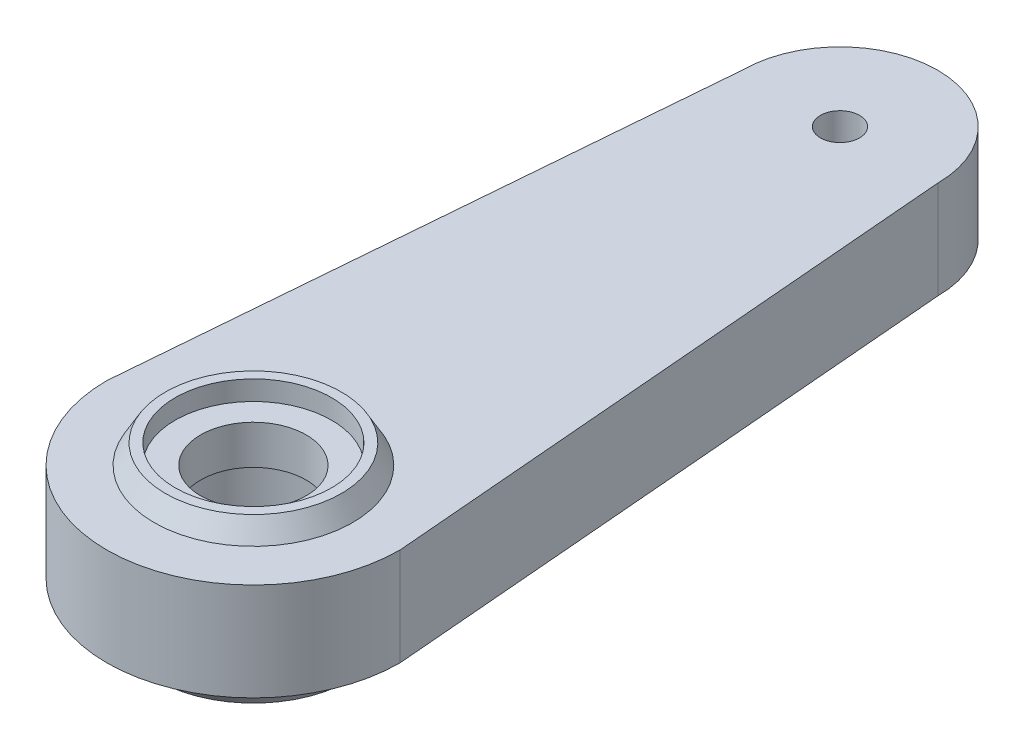
ISO-10303-21;
HEADER;
FILE_DESCRIPTION(('STEP AP214'),'2;1');
FILE_NAME('part.step','',(''),(''),'','','');
FILE_SCHEMA(('AUTOMOTIVE_DESIGN { 1 0 10303 214 1 1 1 1 }'));
ENDSEC;
DATA;
#1=APPLICATION_CONTEXT('core data for automotive mechanical design processes');
#2=APPLICATION_PROTOCOL_DEFINITION('international standard','automotive_design',2000,#1);
#3=PRODUCT_CONTEXT('',#1,'mechanical');
#4=PRODUCT('Part','Part','',(#3));
#5=PRODUCT_RELATED_PRODUCT_CATEGORY('part','',(#4));
#6=PRODUCT_DEFINITION_FORMATION('','',#4);
#7=PRODUCT_DEFINITION_CONTEXT('part definition',#1,'design');
#8=PRODUCT_DEFINITION('design','',#6,#7);
#9=PRODUCT_DEFINITION_SHAPE('','',#8);
#10=(LENGTH_UNIT() NAMED_UNIT(*) SI_UNIT(.MILLI.,.METRE.));
#11=(NAMED_UNIT(*) PLANE_ANGLE_UNIT() SI_UNIT($,.RADIAN.));
#12=(NAMED_UNIT(*) SI_UNIT($,.STERADIAN.) SOLID_ANGLE_UNIT());
#13=UNCERTAINTY_MEASURE_WITH_UNIT(LENGTH_MEASURE(1.E-05),#10,'distance_accuracy_value','');
#14=(GEOMETRIC_REPRESENTATION_CONTEXT(3) GLOBAL_UNCERTAINTY_ASSIGNED_CONTEXT((#13)) GLOBAL_UNIT_ASSIGNED_CONTEXT((#10,
#11,#12)) REPRESENTATION_CONTEXT('',''));
#15=CARTESIAN_POINT('',(0.,0.,0.));
#16=DIRECTION('',(0.,0.,1.));
#17=DIRECTION('',(1.,0.,0.));
#18=AXIS2_PLACEMENT_3D('',#15,#16,#17);
#19=CARTESIAN_POINT('',(0.,5.,0.));
#20=DIRECTION('',(0.,1.,0.));
#21=DIRECTION('',(0.,0.,1.));
#22=AXIS2_PLACEMENT_3D('',#19,#20,#21);
#23=PLANE('',#22);
#24=CARTESIAN_POINT('',(0.,5.,0.));
#25=DIRECTION('',(0.,1.,0.));
#26=DIRECTION('',(0.,0.,1.));
#27=AXIS2_PLACEMENT_3D('',#24,#25,#26);
#28=CIRCLE('',#27,2.7009170163784);
#29=CARTESIAN_POINT('',(0.,5.,2.7009170163784));
#30=VERTEX_POINT('',#29);
#31=EDGE_CURVE('E182',#30,#30,#28,.T.);
#32=ORIENTED_EDGE('',*,*,#31,.F.);
#33=EDGE_LOOP('',(#32));
#34=FACE_BOUND('',#33,.T.);
#35=CARTESIAN_POINT('',(0.,5.,0.));
#36=DIRECTION('',(0.,1.,0.));
#37=DIRECTION('',(0.,0.,1.));
#38=AXIS2_PLACEMENT_3D('',#35,#36,#37);
#39=CIRCLE('',#38,4.);
#40=CARTESIAN_POINT('',(0.,5.,4.));
#41=VERTEX_POINT('',#40);
#42=EDGE_CURVE('E11',#41,#41,#39,.F.);
#43=ORIENTED_EDGE('',*,*,#42,.F.);
#44=EDGE_LOOP('',(#43));
#45=FACE_BOUND('',#44,.T.);
#46=ADVANCED_FACE('F34',(#34,#45),#23,.T.);
#47=CARTESIAN_POINT('',(0.,0.,0.));
#48=DIRECTION('',(0.,1.,0.));
#49=DIRECTION('',(0.,0.,1.));
#50=AXIS2_PLACEMENT_3D('',#47,#48,#49);
#51=CYLINDRICAL_SURFACE('',#50,4.);
#52=CARTESIAN_POINT('',(0.,-2.,0.));
#53=DIRECTION('',(0.,1.,0.));
#54=DIRECTION('',(0.,0.,1.));
#55=AXIS2_PLACEMENT_3D('',#52,#53,#54);
#56=CIRCLE('',#55,4.);
#57=CARTESIAN_POINT('',(0.,-2.,4.));
#58=VERTEX_POINT('',#57);
#59=EDGE_CURVE('E178',#58,#58,#56,.T.);
#60=ORIENTED_EDGE('',*,*,#59,.F.);
#61=EDGE_LOOP('',(#60));
#62=FACE_BOUND('',#61,.T.);
#63=CARTESIAN_POINT('',(0.,3.,0.));
#64=DIRECTION('',(0.,1.,0.));
#65=DIRECTION('',(0.,0.,1.));
#66=AXIS2_PLACEMENT_3D('',#63,#64,#65);
#67=CIRCLE('',#66,4.);
#68=CARTESIAN_POINT('',(0.,3.,4.));
#69=VERTEX_POINT('',#68);
#70=EDGE_CURVE('E44',#69,#69,#67,.F.);
#71=ORIENTED_EDGE('',*,*,#70,.F.);
#72=EDGE_LOOP('',(#71));
#73=FACE_BOUND('',#72,.T.);
#74=ADVANCED_FACE('F121',(#62,#73),#51,.F.);
#75=CARTESIAN_POINT('',(0.,5.,0.));
#76=DIRECTION('',(0.,-1.,0.));
#77=DIRECTION('',(0.,0.,-1.));
#78=AXIS2_PLACEMENT_3D('',#75,#76,#77);
#79=CYLINDRICAL_SURFACE('',#78,7.5);
#80=CARTESIAN_POINT('',(0.,0.,0.));
#81=DIRECTION('',(0.,1.,0.));
#82=DIRECTION('',(0.,0.,1.));
#83=AXIS2_PLACEMENT_3D('',#80,#81,#82);
#84=CIRCLE('',#83,7.5);
#85=CARTESIAN_POINT('',(-7.5,0.,0.));
#86=VERTEX_POINT('',#85);
#87=CARTESIAN_POINT('',(7.5,0.,0.));
#88=VERTEX_POINT('',#87);
#89=EDGE_CURVE('E103',#86,#88,#84,.T.);
#90=ORIENTED_EDGE('',*,*,#89,.T.);
#91=DIRECTION('',(0.,-1.,0.));
#92=VECTOR('',#91,1.);
#93=CARTESIAN_POINT('',(7.5,5.,0.));
#94=LINE('',#93,#92);
#95=CARTESIAN_POINT('',(7.5,5.,0.));
#96=VERTEX_POINT('',#95);
#97=EDGE_CURVE('E94',#96,#88,#94,.T.);
#98=ORIENTED_EDGE('',*,*,#97,.F.);
#99=CARTESIAN_POINT('',(0.,5.,0.));
#100=DIRECTION('',(0.,1.,0.));
#101=DIRECTION('',(0.,0.,1.));
#102=AXIS2_PLACEMENT_3D('',#99,#100,#101);
#103=CIRCLE('',#102,7.5);
#104=CARTESIAN_POINT('',(-7.5,5.,0.));
#105=VERTEX_POINT('',#104);
#106=EDGE_CURVE('E88',#105,#96,#103,.T.);
#107=ORIENTED_EDGE('',*,*,#106,.F.);
#108=DIRECTION('',(0.,-1.,0.));
#109=VECTOR('',#108,1.);
#110=CARTESIAN_POINT('',(-7.5,5.,0.));
#111=LINE('',#110,#109);
#112=EDGE_CURVE('E99',#105,#86,#111,.T.);
#113=ORIENTED_EDGE('',*,*,#112,.T.);
#114=EDGE_LOOP('',(#90,#98,#107,#113));
#115=FACE_BOUND('',#114,.T.);
#116=ADVANCED_FACE('F123',(#115),#79,.T.);
#117=CARTESIAN_POINT('',(5.,5.,-30.));
#118=DIRECTION('',(-0.99654575824488,0.,0.08304547985374));
#119=DIRECTION('',(0.08304547985374,0.,0.99654575824488));
#120=AXIS2_PLACEMENT_3D('',#117,#118,#119);
#121=PLANE('',#120);
#122=DIRECTION('',(-0.08304547985374,0.,-0.99654575824488));
#123=VECTOR('',#122,1.);
#124=CARTESIAN_POINT('',(5.,0.,-30.));
#125=LINE('',#124,#123);
#126=CARTESIAN_POINT('',(5.,0.,-30.));
#127=VERTEX_POINT('',#126);
#128=EDGE_CURVE('E93',#88,#127,#125,.T.);
#129=ORIENTED_EDGE('',*,*,#128,.T.);
#130=DIRECTION('',(0.,-1.,0.));
#131=VECTOR('',#130,1.);
#132=CARTESIAN_POINT('',(5.,5.,-30.));
#133=LINE('',#132,#131);
#134=CARTESIAN_POINT('',(5.,5.,-30.));
#135=VERTEX_POINT('',#134);
#136=EDGE_CURVE('E91',#135,#127,#133,.T.);
#137=ORIENTED_EDGE('',*,*,#136,.F.);
#138=DIRECTION('',(-0.08304547985374,0.,-0.99654575824488));
#139=VECTOR('',#138,1.);
#140=CARTESIAN_POINT('',(5.,5.,-30.));
#141=LINE('',#140,#139);
#142=EDGE_CURVE('E83',#96,#135,#141,.T.);
#143=ORIENTED_EDGE('',*,*,#142,.F.);
#144=ORIENTED_EDGE('',*,*,#97,.T.);
#145=EDGE_LOOP('',(#129,#137,#143,#144));
#146=FACE_BOUND('',#145,.T.);
#147=ADVANCED_FACE('F92',(#146),#121,.F.);
#148=CARTESIAN_POINT('',(0.,5.,-30.));
#149=DIRECTION('',(0.,-1.,0.));
#150=DIRECTION('',(0.,0.,-1.));
#151=AXIS2_PLACEMENT_3D('',#148,#149,#150);
#152=CYLINDRICAL_SURFACE('',#151,5.);
#153=CARTESIAN_POINT('',(0.,0.,-30.));
#154=DIRECTION('',(0.,1.,0.));
#155=DIRECTION('',(0.,0.,1.));
#156=AXIS2_PLACEMENT_3D('',#153,#154,#155);
#157=CIRCLE('',#156,5.);
#158=CARTESIAN_POINT('',(-5.,0.,-30.));
#159=VERTEX_POINT('',#158);
#160=EDGE_CURVE('E69',#127,#159,#157,.T.);
#161=ORIENTED_EDGE('',*,*,#160,.T.);
#162=DIRECTION('',(0.,-1.,0.));
#163=VECTOR('',#162,1.);
#164=CARTESIAN_POINT('',(-5.,5.,-30.));
#165=LINE('',#164,#163);
#166=CARTESIAN_POINT('',(-5.,5.,-30.));
#167=VERTEX_POINT('',#166);
#168=EDGE_CURVE('E95',#167,#159,#165,.T.);
#169=ORIENTED_EDGE('',*,*,#168,.F.);
#170=CARTESIAN_POINT('',(0.,5.,-30.));
#171=DIRECTION('',(0.,1.,0.));
#172=DIRECTION('',(0.,0.,1.));
#173=AXIS2_PLACEMENT_3D('',#170,#171,#172);
#174=CIRCLE('',#173,5.);
#175=EDGE_CURVE('E86',#135,#167,#174,.T.);
#176=ORIENTED_EDGE('',*,*,#175,.F.);
#177=ORIENTED_EDGE('',*,*,#136,.T.);
#178=EDGE_LOOP('',(#161,#169,#176,#177));
#179=FACE_BOUND('',#178,.T.);
#180=ADVANCED_FACE('F97',(#179),#152,.T.);
#181=CARTESIAN_POINT('',(-7.5,5.,0.));
#182=DIRECTION('',(0.99654575824488,0.,0.08304547985374));
#183=DIRECTION('',(0.08304547985374,0.,-0.99654575824488));
#184=AXIS2_PLACEMENT_3D('',#181,#182,#183);
#185=PLANE('',#184);
#186=DIRECTION('',(-0.08304547985374,0.,0.99654575824488));
#187=VECTOR('',#186,1.);
#188=CARTESIAN_POINT('',(-7.5,0.,0.));
#189=LINE('',#188,#187);
#190=EDGE_CURVE('E75',#159,#86,#189,.T.);
#191=ORIENTED_EDGE('',*,*,#190,.T.);
#192=ORIENTED_EDGE('',*,*,#112,.F.);
#193=DIRECTION('',(-0.08304547985374,0.,0.99654575824488));
#194=VECTOR('',#193,1.);
#195=CARTESIAN_POINT('',(-7.5,5.,0.));
#196=LINE('',#195,#194);
#197=EDGE_CURVE('E52',#167,#105,#196,.T.);
#198=ORIENTED_EDGE('',*,*,#197,.F.);
#199=ORIENTED_EDGE('',*,*,#168,.T.);
#200=EDGE_LOOP('',(#191,#192,#198,#199));
#201=FACE_BOUND('',#200,.T.);
#202=ADVANCED_FACE('F146',(#201),#185,.F.);
#203=CARTESIAN_POINT('',(0.,5.,0.));
#204=DIRECTION('',(0.,1.,0.));
#205=DIRECTION('',(0.,0.,1.));
#206=AXIS2_PLACEMENT_3D('',#203,#204,#205);
#207=CIRCLE('',#206,5.07735026918963);
#208=CARTESIAN_POINT('',(0.,5.,5.07735026918963));
#209=VERTEX_POINT('',#208);
#210=EDGE_CURVE('E38',#209,#209,#207,.T.);
#211=ORIENTED_EDGE('',*,*,#210,.F.);
#212=EDGE_LOOP('',(#211));
#213=FACE_BOUND('',#212,.T.);
#214=CARTESIAN_POINT('',(0.,5.,-30.));
#215=DIRECTION('',(0.,1.,0.));
#216=DIRECTION('',(0.,0.,1.));
#217=AXIS2_PLACEMENT_3D('',#214,#215,#216);
#218=CIRCLE('',#217,1.);
#219=CARTESIAN_POINT('',(0.,5.,-29.));
#220=VERTEX_POINT('',#219);
#221=EDGE_CURVE('E173',#220,#220,#218,.T.);
#222=ORIENTED_EDGE('',*,*,#221,.F.);
#223=EDGE_LOOP('',(#222));
#224=FACE_BOUND('',#223,.T.);
#225=ORIENTED_EDGE('',*,*,#106,.T.);
#226=ORIENTED_EDGE('',*,*,#142,.T.);
#227=ORIENTED_EDGE('',*,*,#175,.T.);
#228=ORIENTED_EDGE('',*,*,#197,.T.);
#229=EDGE_LOOP('',(#225,#226,#227,#228));
#230=FACE_BOUND('',#229,.T.);
#231=ADVANCED_FACE('F84',(#213,#224,#230),#23,.T.);
#232=CARTESIAN_POINT('',(0.,0.,0.));
#233=DIRECTION('',(0.,1.,0.));
#234=DIRECTION('',(0.,0.,1.));
#235=AXIS2_PLACEMENT_3D('',#232,#233,#234);
#236=PLANE('',#235);
#237=CARTESIAN_POINT('',(0.,0.,0.));
#238=DIRECTION('',(0.,1.,0.));
#239=DIRECTION('',(0.,0.,1.));
#240=AXIS2_PLACEMENT_3D('',#237,#238,#239);
#241=CIRCLE('',#240,6.15470053837925);
#242=CARTESIAN_POINT('',(0.,0.,6.15470053837925));
#243=VERTEX_POINT('',#242);
#244=EDGE_CURVE('E113',#243,#243,#241,.F.);
#245=ORIENTED_EDGE('',*,*,#244,.F.);
#246=EDGE_LOOP('',(#245));
#247=FACE_BOUND('',#246,.T.);
#248=CARTESIAN_POINT('',(0.,0.,-30.));
#249=DIRECTION('',(0.,1.,0.));
#250=DIRECTION('',(0.,0.,1.));
#251=AXIS2_PLACEMENT_3D('',#248,#249,#250);
#252=CIRCLE('',#251,1.);
#253=CARTESIAN_POINT('',(0.,0.,-29.));
#254=VERTEX_POINT('',#253);
#255=EDGE_CURVE('E106',#254,#254,#252,.T.);
#256=ORIENTED_EDGE('',*,*,#255,.T.);
#257=EDGE_LOOP('',(#256));
#258=FACE_BOUND('',#257,.T.);
#259=ORIENTED_EDGE('',*,*,#89,.F.);
#260=ORIENTED_EDGE('',*,*,#190,.F.);
#261=ORIENTED_EDGE('',*,*,#160,.F.);
#262=ORIENTED_EDGE('',*,*,#128,.F.);
#263=EDGE_LOOP('',(#259,#260,#261,#262));
#264=FACE_BOUND('',#263,.T.);
#265=ADVANCED_FACE('F142',(#247,#258,#264),#236,.F.);
#266=CARTESIAN_POINT('',(0.,0.,-30.));
#267=DIRECTION('',(0.,1.,0.));
#268=DIRECTION('',(0.,0.,1.));
#269=AXIS2_PLACEMENT_3D('',#266,#267,#268);
#270=CYLINDRICAL_SURFACE('',#269,1.);
#271=ORIENTED_EDGE('',*,*,#255,.F.);
#272=EDGE_LOOP('',(#271));
#273=FACE_BOUND('',#272,.T.);
#274=ORIENTED_EDGE('',*,*,#221,.T.);
#275=EDGE_LOOP('',(#274));
#276=FACE_BOUND('',#275,.T.);
#277=ADVANCED_FACE('F139',(#273,#276),#270,.F.);
#278=CARTESIAN_POINT('',(0.,-2.,0.));
#279=DIRECTION('',(0.,1.,0.));
#280=DIRECTION('',(0.,0.,-1.));
#281=AXIS2_PLACEMENT_3D('',#278,#279,#280);
#282=CONICAL_SURFACE('',#281,5.,0.5235987755983);
#283=CARTESIAN_POINT('',(0.,-2.,0.));
#284=DIRECTION('',(0.,-1.,0.));
#285=DIRECTION('',(0.,0.,-1.));
#286=AXIS2_PLACEMENT_3D('',#283,#284,#285);
#287=CIRCLE('',#286,5.);
#288=CARTESIAN_POINT('',(0.,-2.,-5.));
#289=VERTEX_POINT('',#288);
#290=EDGE_CURVE('E165',#289,#289,#287,.T.);
#291=ORIENTED_EDGE('',*,*,#290,.F.);
#292=EDGE_LOOP('',(#291));
#293=FACE_BOUND('',#292,.T.);
#294=ORIENTED_EDGE('',*,*,#244,.T.);
#295=EDGE_LOOP('',(#294));
#296=FACE_BOUND('',#295,.T.);
#297=ADVANCED_FACE('F141',(#293,#296),#282,.T.);
#298=CARTESIAN_POINT('',(0.,-2.,0.));
#299=DIRECTION('',(0.,-1.,0.));
#300=DIRECTION('',(0.,0.,-1.));
#301=AXIS2_PLACEMENT_3D('',#298,#299,#300);
#302=PLANE('',#301);
#303=ORIENTED_EDGE('',*,*,#59,.T.);
#304=EDGE_LOOP('',(#303));
#305=FACE_BOUND('',#304,.T.);
#306=ORIENTED_EDGE('',*,*,#290,.T.);
#307=EDGE_LOOP('',(#306));
#308=FACE_BOUND('',#307,.T.);
#309=ADVANCED_FACE('F137',(#305,#308),#302,.T.);
#310=CARTESIAN_POINT('',(0.,3.,0.));
#311=DIRECTION('',(0.,1.,0.));
#312=DIRECTION('',(0.,0.,1.));
#313=AXIS2_PLACEMENT_3D('',#310,#311,#312);
#314=PLANE('',#313);
#315=CARTESIAN_POINT('',(0.,3.,0.));
#316=DIRECTION('',(0.,1.,0.));
#317=DIRECTION('',(0.,0.,1.));
#318=AXIS2_PLACEMENT_3D('',#315,#316,#317);
#319=CIRCLE('',#318,2.7009170163784);
#320=CARTESIAN_POINT('',(0.,3.,2.7009170163784));
#321=VERTEX_POINT('',#320);
#322=EDGE_CURVE('E181',#321,#321,#319,.T.);
#323=ORIENTED_EDGE('',*,*,#322,.T.);
#324=EDGE_LOOP('',(#323));
#325=FACE_BOUND('',#324,.T.);
#326=ORIENTED_EDGE('',*,*,#70,.T.);
#327=EDGE_LOOP('',(#326));
#328=FACE_BOUND('',#327,.T.);
#329=ADVANCED_FACE('F119',(#325,#328),#314,.F.);
#330=CARTESIAN_POINT('',(0.,3.,0.));
#331=DIRECTION('',(0.,1.,0.));
#332=DIRECTION('',(0.,0.,1.));
#333=AXIS2_PLACEMENT_3D('',#330,#331,#332);
#334=CYLINDRICAL_SURFACE('',#333,2.7009170163784);
#335=ORIENTED_EDGE('',*,*,#322,.F.);
#336=EDGE_LOOP('',(#335));
#337=FACE_BOUND('',#336,.T.);
#338=ORIENTED_EDGE('',*,*,#31,.T.);
#339=EDGE_LOOP('',(#338));
#340=FACE_BOUND('',#339,.T.);
#341=ADVANCED_FACE('F209',(#337,#340),#334,.F.);
#342=CARTESIAN_POINT('',(0.,6.,0.));
#343=DIRECTION('',(0.,1.,0.));
#344=DIRECTION('',(0.,0.,1.));
#345=AXIS2_PLACEMENT_3D('',#342,#343,#344);
#346=PLANE('',#345);
#347=CARTESIAN_POINT('',(0.,6.,0.));
#348=DIRECTION('',(0.,1.,0.));
#349=DIRECTION('',(0.,0.,1.));
#350=AXIS2_PLACEMENT_3D('',#347,#348,#349);
#351=CIRCLE('',#350,4.5);
#352=CARTESIAN_POINT('',(0.,6.,4.5));
#353=VERTEX_POINT('',#352);
#354=EDGE_CURVE('E185',#353,#353,#351,.T.);
#355=ORIENTED_EDGE('',*,*,#354,.T.);
#356=EDGE_LOOP('',(#355));
#357=FACE_BOUND('',#356,.T.);
#358=CARTESIAN_POINT('',(0.,6.,0.));
#359=DIRECTION('',(0.,1.,0.));
#360=DIRECTION('',(0.,0.,1.));
#361=AXIS2_PLACEMENT_3D('',#358,#359,#360);
#362=CIRCLE('',#361,4.);
#363=CARTESIAN_POINT('',(0.,6.,4.));
#364=VERTEX_POINT('',#363);
#365=EDGE_CURVE('E190',#364,#364,#362,.T.);
#366=ORIENTED_EDGE('',*,*,#365,.F.);
#367=EDGE_LOOP('',(#366));
#368=FACE_BOUND('',#367,.T.);
#369=ADVANCED_FACE('F202',(#357,#368),#346,.T.);
#370=CARTESIAN_POINT('',(0.,6.,0.));
#371=DIRECTION('',(0.,-1.,0.));
#372=DIRECTION('',(0.,0.,1.));
#373=AXIS2_PLACEMENT_3D('',#370,#371,#372);
#374=CONICAL_SURFACE('',#373,4.5,0.5235987755983);
#375=ORIENTED_EDGE('',*,*,#354,.F.);
#376=EDGE_LOOP('',(#375));
#377=FACE_BOUND('',#376,.T.);
#378=ORIENTED_EDGE('',*,*,#210,.T.);
#379=EDGE_LOOP('',(#378));
#380=FACE_BOUND('',#379,.T.);
#381=ADVANCED_FACE('F36',(#377,#380),#374,.T.);
#382=CARTESIAN_POINT('',(0.,6.,0.));
#383=DIRECTION('',(0.,-1.,0.));
#384=DIRECTION('',(0.,0.,-1.));
#385=AXIS2_PLACEMENT_3D('',#382,#383,#384);
#386=CYLINDRICAL_SURFACE('',#385,4.);
#387=ORIENTED_EDGE('',*,*,#365,.T.);
#388=EDGE_LOOP('',(#387));
#389=FACE_BOUND('',#388,.T.);
#390=ORIENTED_EDGE('',*,*,#42,.T.);
#391=EDGE_LOOP('',(#390));
#392=FACE_BOUND('',#391,.T.);
#393=ADVANCED_FACE('F201',(#389,#392),#386,.F.);
#394=CLOSED_SHELL('',(#46,#74,#116,#147,#180,#202,#231,#265,#277,#297,#309,#329,#341,#369,#381,#393));
#395=MANIFOLD_SOLID_BREP('B2',#394);
#396=ADVANCED_BREP_SHAPE_REPRESENTATION('',(#18,#395),#14);
#397=SHAPE_DEFINITION_REPRESENTATION(#9,#396);
ENDSEC;
END-ISO-10303-21;
